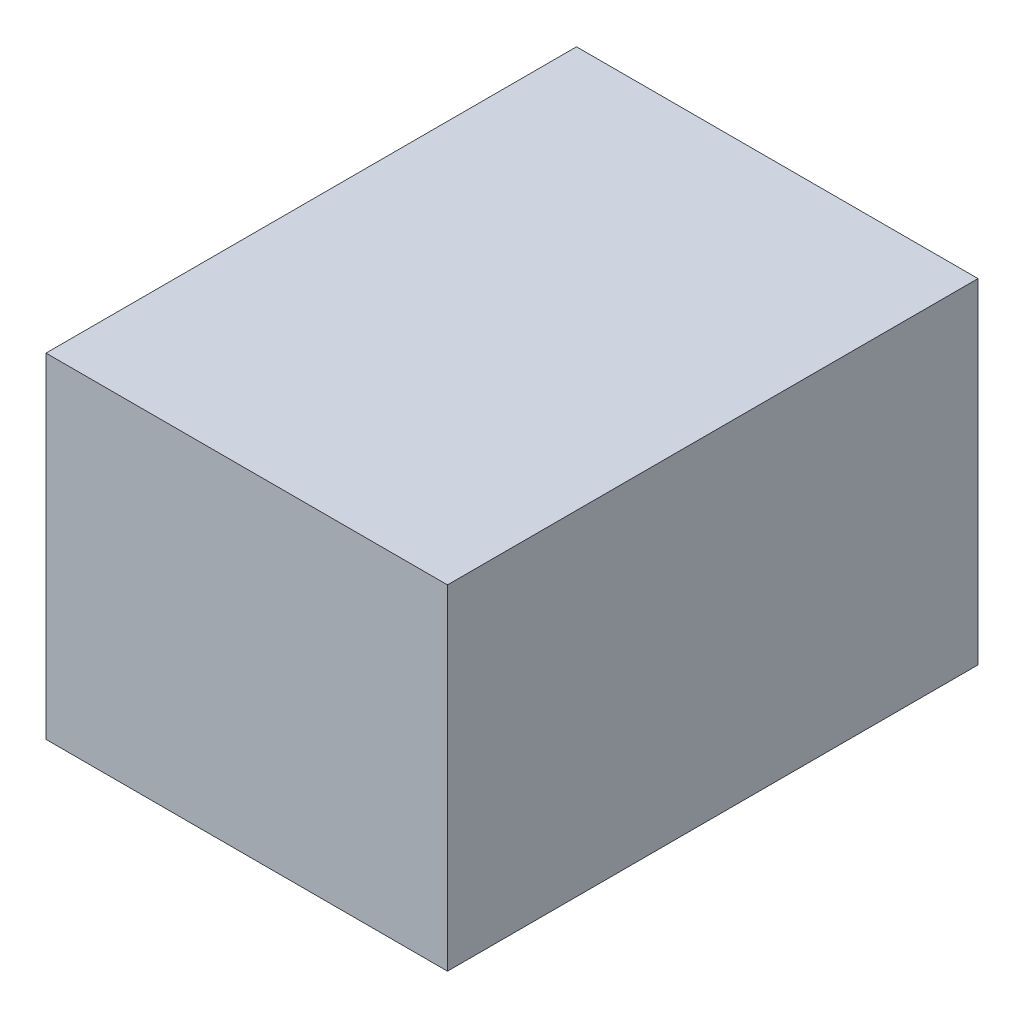
ISO-10303-21;
HEADER;
FILE_DESCRIPTION(('STEP AP214'),'2;1');
FILE_NAME('part.step','',(''),(''),'','','');
FILE_SCHEMA(('AUTOMOTIVE_DESIGN { 1 0 10303 214 1 1 1 1 }'));
ENDSEC;
DATA;
#1=APPLICATION_CONTEXT('core data for automotive mechanical design processes');
#2=APPLICATION_PROTOCOL_DEFINITION('international standard','automotive_design',2000,#1);
#3=PRODUCT_CONTEXT('',#1,'mechanical');
#4=PRODUCT('Part','Part','',(#3));
#5=PRODUCT_RELATED_PRODUCT_CATEGORY('part','',(#4));
#6=PRODUCT_DEFINITION_FORMATION('','',#4);
#7=PRODUCT_DEFINITION_CONTEXT('part definition',#1,'design');
#8=PRODUCT_DEFINITION('design','',#6,#7);
#9=PRODUCT_DEFINITION_SHAPE('','',#8);
#10=(LENGTH_UNIT() NAMED_UNIT(*) SI_UNIT(.MILLI.,.METRE.));
#11=(NAMED_UNIT(*) PLANE_ANGLE_UNIT() SI_UNIT($,.RADIAN.));
#12=(NAMED_UNIT(*) SI_UNIT($,.STERADIAN.) SOLID_ANGLE_UNIT());
#13=UNCERTAINTY_MEASURE_WITH_UNIT(LENGTH_MEASURE(1.E-05),#10,'distance_accuracy_value','');
#14=(GEOMETRIC_REPRESENTATION_CONTEXT(3) GLOBAL_UNCERTAINTY_ASSIGNED_CONTEXT((#13)) GLOBAL_UNIT_ASSIGNED_CONTEXT((#10,
#11,#12)) REPRESENTATION_CONTEXT('',''));
#15=CARTESIAN_POINT('',(0.,0.,0.));
#16=DIRECTION('',(0.,0.,1.));
#17=DIRECTION('',(1.,0.,0.));
#18=AXIS2_PLACEMENT_3D('',#15,#16,#17);
#19=CARTESIAN_POINT('',(551.669086835848,96.3157017452683,-60.0334142410146));
#20=DIRECTION('',(0.,1.,0.));
#21=DIRECTION('',(0.,0.,1.));
#22=AXIS2_PLACEMENT_3D('',#19,#20,#21);
#23=PLANE('',#22);
#24=DIRECTION('',(-1.,0.,0.));
#25=VECTOR('',#24,1.);
#26=CARTESIAN_POINT('',(548.894917120642,96.3157017452683,-66.0563605183514));
#27=LINE('',#26,#25);
#28=CARTESIAN_POINT('',(554.894917120642,96.3157017452683,-66.0563605183514));
#29=VERTEX_POINT('',#28);
#30=CARTESIAN_POINT('',(548.894917120642,96.3157017452683,-66.0563605183514));
#31=VERTEX_POINT('',#30);
#32=EDGE_CURVE('E55',#29,#31,#27,.T.);
#33=ORIENTED_EDGE('',*,*,#32,.F.);
#34=DIRECTION('',(0.,0.,-1.));
#35=VECTOR('',#34,1.);
#36=CARTESIAN_POINT('',(554.894917120642,96.3157017452683,-66.0563605183514));
#37=LINE('',#36,#35);
#38=CARTESIAN_POINT('',(554.894917120642,96.3157017452683,-58.1281572880758));
#39=VERTEX_POINT('',#38);
#40=EDGE_CURVE('E57',#39,#29,#37,.T.);
#41=ORIENTED_EDGE('',*,*,#40,.F.);
#42=DIRECTION('',(1.,0.,0.));
#43=VECTOR('',#42,1.);
#44=CARTESIAN_POINT('',(554.894917120642,96.3157017452683,-58.1281572880758));
#45=LINE('',#44,#43);
#46=CARTESIAN_POINT('',(548.894917120642,96.3157017452683,-58.1281572880758));
#47=VERTEX_POINT('',#46);
#48=EDGE_CURVE('E20',#47,#39,#45,.T.);
#49=ORIENTED_EDGE('',*,*,#48,.F.);
#50=DIRECTION('',(0.,0.,1.));
#51=VECTOR('',#50,1.);
#52=CARTESIAN_POINT('',(548.894917120642,96.3157017452683,-58.1281572880758));
#53=LINE('',#52,#51);
#54=EDGE_CURVE('E79',#31,#47,#53,.T.);
#55=ORIENTED_EDGE('',*,*,#54,.F.);
#56=EDGE_LOOP('',(#33,#41,#49,#55));
#57=FACE_BOUND('',#56,.T.);
#58=ADVANCED_FACE('F17',(#57),#23,.F.);
#59=CARTESIAN_POINT('',(554.894917120642,96.3157017452683,-58.1281572880758));
#60=DIRECTION('',(0.,0.,1.));
#61=DIRECTION('',(1.,0.,0.));
#62=AXIS2_PLACEMENT_3D('',#59,#60,#61);
#63=PLANE('',#62);
#64=DIRECTION('',(1.,0.,0.));
#65=VECTOR('',#64,1.);
#66=CARTESIAN_POINT('',(551.669086835848,101.315701745268,-58.1281572880758));
#67=LINE('',#66,#65);
#68=CARTESIAN_POINT('',(548.894917120642,101.315701745268,-58.1281572880758));
#69=VERTEX_POINT('',#68);
#70=CARTESIAN_POINT('',(554.894917120642,101.315701745268,-58.1281572880758));
#71=VERTEX_POINT('',#70);
#72=EDGE_CURVE('E83',#69,#71,#67,.T.);
#73=ORIENTED_EDGE('',*,*,#72,.F.);
#74=DIRECTION('',(0.,1.,0.));
#75=VECTOR('',#74,1.);
#76=CARTESIAN_POINT('',(548.894917120642,96.3157017452683,-58.1281572880758));
#77=LINE('',#76,#75);
#78=EDGE_CURVE('E68',#47,#69,#77,.T.);
#79=ORIENTED_EDGE('',*,*,#78,.F.);
#80=ORIENTED_EDGE('',*,*,#48,.T.);
#81=DIRECTION('',(0.,1.,0.));
#82=VECTOR('',#81,1.);
#83=CARTESIAN_POINT('',(554.894917120642,96.3157017452683,-58.1281572880758));
#84=LINE('',#83,#82);
#85=EDGE_CURVE('E63',#71,#39,#84,.F.);
#86=ORIENTED_EDGE('',*,*,#85,.F.);
#87=EDGE_LOOP('',(#73,#79,#80,#86));
#88=FACE_BOUND('',#87,.T.);
#89=ADVANCED_FACE('F65',(#88),#63,.T.);
#90=CARTESIAN_POINT('',(554.894917120642,96.3157017452683,-66.0563605183514));
#91=DIRECTION('',(1.,0.,0.));
#92=DIRECTION('',(0.,0.,-1.));
#93=AXIS2_PLACEMENT_3D('',#90,#91,#92);
#94=PLANE('',#93);
#95=DIRECTION('',(0.,0.,1.));
#96=VECTOR('',#95,1.);
#97=CARTESIAN_POINT('',(554.894917120642,101.315701745268,-60.0334142410146));
#98=LINE('',#97,#96);
#99=CARTESIAN_POINT('',(554.894917120642,101.315701745268,-66.0563605183514));
#100=VERTEX_POINT('',#99);
#101=EDGE_CURVE('E72',#71,#100,#98,.F.);
#102=ORIENTED_EDGE('',*,*,#101,.F.);
#103=ORIENTED_EDGE('',*,*,#85,.T.);
#104=ORIENTED_EDGE('',*,*,#40,.T.);
#105=DIRECTION('',(0.,1.,0.));
#106=VECTOR('',#105,1.);
#107=CARTESIAN_POINT('',(554.894917120642,96.3157017452683,-66.0563605183514));
#108=LINE('',#107,#106);
#109=EDGE_CURVE('E75',#100,#29,#108,.F.);
#110=ORIENTED_EDGE('',*,*,#109,.F.);
#111=EDGE_LOOP('',(#102,#103,#104,#110));
#112=FACE_BOUND('',#111,.T.);
#113=ADVANCED_FACE('F70',(#112),#94,.T.);
#114=CARTESIAN_POINT('',(548.894917120642,96.3157017452683,-66.0563605183514));
#115=DIRECTION('',(0.,0.,-1.));
#116=DIRECTION('',(-1.,0.,0.));
#117=AXIS2_PLACEMENT_3D('',#114,#115,#116);
#118=PLANE('',#117);
#119=DIRECTION('',(1.,0.,0.));
#120=VECTOR('',#119,1.);
#121=CARTESIAN_POINT('',(551.669086835848,101.315701745268,-66.0563605183514));
#122=LINE('',#121,#120);
#123=CARTESIAN_POINT('',(548.894917120642,101.315701745268,-66.0563605183514));
#124=VERTEX_POINT('',#123);
#125=EDGE_CURVE('E26',#100,#124,#122,.F.);
#126=ORIENTED_EDGE('',*,*,#125,.F.);
#127=ORIENTED_EDGE('',*,*,#109,.T.);
#128=ORIENTED_EDGE('',*,*,#32,.T.);
#129=DIRECTION('',(0.,1.,0.));
#130=VECTOR('',#129,1.);
#131=CARTESIAN_POINT('',(548.894917120642,96.3157017452683,-66.0563605183514));
#132=LINE('',#131,#130);
#133=EDGE_CURVE('E35',#124,#31,#132,.F.);
#134=ORIENTED_EDGE('',*,*,#133,.F.);
#135=EDGE_LOOP('',(#126,#127,#128,#134));
#136=FACE_BOUND('',#135,.T.);
#137=ADVANCED_FACE('F89',(#136),#118,.T.);
#138=CARTESIAN_POINT('',(548.894917120642,96.3157017452683,-58.1281572880758));
#139=DIRECTION('',(-1.,0.,0.));
#140=DIRECTION('',(0.,0.,1.));
#141=AXIS2_PLACEMENT_3D('',#138,#139,#140);
#142=PLANE('',#141);
#143=DIRECTION('',(0.,0.,1.));
#144=VECTOR('',#143,1.);
#145=CARTESIAN_POINT('',(548.894917120642,101.315701745268,-60.0334142410146));
#146=LINE('',#145,#144);
#147=EDGE_CURVE('E11',#124,#69,#146,.T.);
#148=ORIENTED_EDGE('',*,*,#147,.F.);
#149=ORIENTED_EDGE('',*,*,#133,.T.);
#150=ORIENTED_EDGE('',*,*,#54,.T.);
#151=ORIENTED_EDGE('',*,*,#78,.T.);
#152=EDGE_LOOP('',(#148,#149,#150,#151));
#153=FACE_BOUND('',#152,.T.);
#154=ADVANCED_FACE('F91',(#153),#142,.T.);
#155=CARTESIAN_POINT('',(551.669086835848,101.315701745268,-60.0334142410146));
#156=DIRECTION('',(0.,1.,0.));
#157=DIRECTION('',(0.,0.,1.));
#158=AXIS2_PLACEMENT_3D('',#155,#156,#157);
#159=PLANE('',#158);
#160=ORIENTED_EDGE('',*,*,#125,.T.);
#161=ORIENTED_EDGE('',*,*,#147,.T.);
#162=ORIENTED_EDGE('',*,*,#72,.T.);
#163=ORIENTED_EDGE('',*,*,#101,.T.);
#164=EDGE_LOOP('',(#160,#161,#162,#163));
#165=FACE_BOUND('',#164,.T.);
#166=ADVANCED_FACE('F88',(#165),#159,.T.);
#167=CLOSED_SHELL('',(#58,#89,#113,#137,#154,#166));
#168=MANIFOLD_SOLID_BREP('B1',#167);
#169=ADVANCED_BREP_SHAPE_REPRESENTATION('',(#18,#168),#14);
#170=SHAPE_DEFINITION_REPRESENTATION(#9,#169);
ENDSEC;
END-ISO-10303-21;
